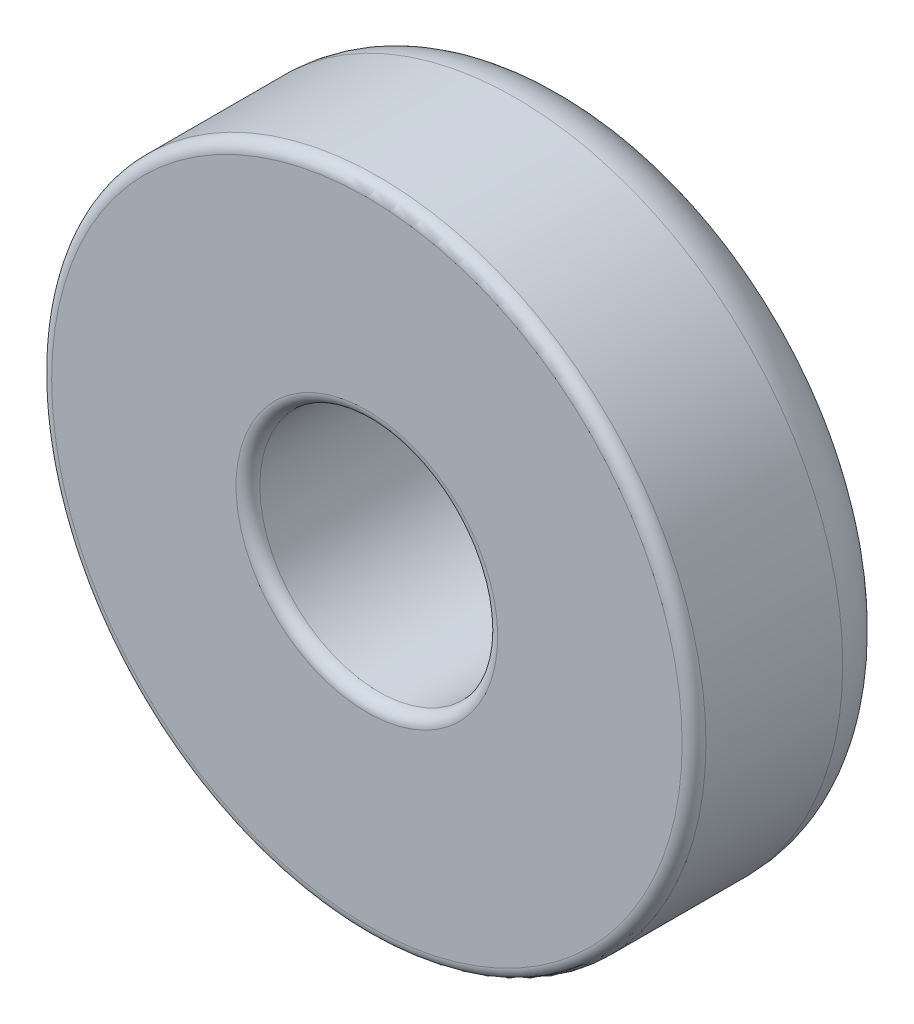
ISO-10303-21;
HEADER;
FILE_DESCRIPTION(('STEP AP214'),'2;1');
FILE_NAME('part.step','',(''),(''),'','','');
FILE_SCHEMA(('AUTOMOTIVE_DESIGN { 1 0 10303 214 1 1 1 1 }'));
ENDSEC;
DATA;
#1=APPLICATION_CONTEXT('core data for automotive mechanical design processes');
#2=APPLICATION_PROTOCOL_DEFINITION('international standard','automotive_design',2000,#1);
#3=PRODUCT_CONTEXT('',#1,'mechanical');
#4=PRODUCT('Part','Part','',(#3));
#5=PRODUCT_RELATED_PRODUCT_CATEGORY('part','',(#4));
#6=PRODUCT_DEFINITION_FORMATION('','',#4);
#7=PRODUCT_DEFINITION_CONTEXT('part definition',#1,'design');
#8=PRODUCT_DEFINITION('design','',#6,#7);
#9=PRODUCT_DEFINITION_SHAPE('','',#8);
#10=(LENGTH_UNIT() NAMED_UNIT(*) SI_UNIT(.MILLI.,.METRE.));
#11=(NAMED_UNIT(*) PLANE_ANGLE_UNIT() SI_UNIT($,.RADIAN.));
#12=(NAMED_UNIT(*) SI_UNIT($,.STERADIAN.) SOLID_ANGLE_UNIT());
#13=UNCERTAINTY_MEASURE_WITH_UNIT(LENGTH_MEASURE(1.E-05),#10,'distance_accuracy_value','');
#14=(GEOMETRIC_REPRESENTATION_CONTEXT(3) GLOBAL_UNCERTAINTY_ASSIGNED_CONTEXT((#13)) GLOBAL_UNIT_ASSIGNED_CONTEXT((#10,
#11,#12)) REPRESENTATION_CONTEXT('',''));
#15=CARTESIAN_POINT('',(0.,0.,0.));
#16=DIRECTION('',(0.,0.,1.));
#17=DIRECTION('',(1.,0.,0.));
#18=AXIS2_PLACEMENT_3D('',#15,#16,#17);
#19=CARTESIAN_POINT('',(0.,0.,1.75));
#20=DIRECTION('',(0.,0.,1.));
#21=DIRECTION('',(1.,0.,0.));
#22=AXIS2_PLACEMENT_3D('',#19,#20,#21);
#23=PLANE('',#22);
#24=CARTESIAN_POINT('',(0.,0.,1.75));
#25=DIRECTION('',(0.,0.,1.));
#26=DIRECTION('',(1.,0.,0.));
#27=AXIS2_PLACEMENT_3D('',#24,#25,#26);
#28=CIRCLE('',#27,2.65);
#29=CARTESIAN_POINT('',(2.65,0.,1.75));
#30=VERTEX_POINT('',#29);
#31=EDGE_CURVE('E65',#30,#30,#28,.T.);
#32=ORIENTED_EDGE('',*,*,#31,.T.);
#33=EDGE_LOOP('',(#32));
#34=FACE_BOUND('',#33,.T.);
#35=CARTESIAN_POINT('',(0.,0.,1.75));
#36=DIRECTION('',(0.,0.,1.));
#37=DIRECTION('',(1.,0.,0.));
#38=AXIS2_PLACEMENT_3D('',#35,#36,#37);
#39=CIRCLE('',#38,1.1);
#40=CARTESIAN_POINT('',(1.1,0.,1.75));
#41=VERTEX_POINT('',#40);
#42=EDGE_CURVE('E68',#41,#41,#39,.F.);
#43=ORIENTED_EDGE('',*,*,#42,.T.);
#44=EDGE_LOOP('',(#43));
#45=FACE_BOUND('',#44,.T.);
#46=ADVANCED_FACE('F45',(#34,#45),#23,.T.);
#47=CARTESIAN_POINT('',(0.,0.,0.));
#48=DIRECTION('',(0.,0.,1.));
#49=DIRECTION('',(1.,0.,0.));
#50=AXIS2_PLACEMENT_3D('',#47,#48,#49);
#51=PLANE('',#50);
#52=CARTESIAN_POINT('',(0.,0.,0.));
#53=DIRECTION('',(0.,0.,1.));
#54=DIRECTION('',(1.,0.,0.));
#55=AXIS2_PLACEMENT_3D('',#52,#53,#54);
#56=CIRCLE('',#55,1.1);
#57=CARTESIAN_POINT('',(1.1,0.,0.));
#58=VERTEX_POINT('',#57);
#59=EDGE_CURVE('E11',#58,#58,#56,.T.);
#60=ORIENTED_EDGE('',*,*,#59,.T.);
#61=EDGE_LOOP('',(#60));
#62=FACE_BOUND('',#61,.T.);
#63=CARTESIAN_POINT('',(0.,0.,0.));
#64=DIRECTION('',(0.,0.,1.));
#65=DIRECTION('',(1.,0.,0.));
#66=AXIS2_PLACEMENT_3D('',#63,#64,#65);
#67=CIRCLE('',#66,2.25);
#68=CARTESIAN_POINT('',(2.25,0.,0.));
#69=VERTEX_POINT('',#68);
#70=EDGE_CURVE('E71',#69,#69,#67,.F.);
#71=ORIENTED_EDGE('',*,*,#70,.T.);
#72=EDGE_LOOP('',(#71));
#73=FACE_BOUND('',#72,.T.);
#74=ADVANCED_FACE('F97',(#62,#73),#51,.F.);
#75=CARTESIAN_POINT('',(0.,0.,1.75));
#76=DIRECTION('',(0.,0.,-1.));
#77=DIRECTION('',(-1.,0.,0.));
#78=AXIS2_PLACEMENT_3D('',#75,#76,#77);
#79=CYLINDRICAL_SURFACE('',#78,2.75);
#80=CARTESIAN_POINT('',(0.,0.,1.65));
#81=DIRECTION('',(0.,0.,1.));
#82=DIRECTION('',(1.,0.,0.));
#83=AXIS2_PLACEMENT_3D('',#80,#81,#82);
#84=CIRCLE('',#83,2.75);
#85=CARTESIAN_POINT('',(2.75,0.,1.65));
#86=VERTEX_POINT('',#85);
#87=EDGE_CURVE('E60',#86,#86,#84,.F.);
#88=ORIENTED_EDGE('',*,*,#87,.T.);
#89=EDGE_LOOP('',(#88));
#90=FACE_BOUND('',#89,.T.);
#91=CARTESIAN_POINT('',(0.,0.,0.5));
#92=DIRECTION('',(0.,0.,1.));
#93=DIRECTION('',(1.,0.,0.));
#94=AXIS2_PLACEMENT_3D('',#91,#92,#93);
#95=CIRCLE('',#94,2.75);
#96=CARTESIAN_POINT('',(2.75,0.,0.5));
#97=VERTEX_POINT('',#96);
#98=EDGE_CURVE('E74',#97,#97,#95,.T.);
#99=ORIENTED_EDGE('',*,*,#98,.T.);
#100=EDGE_LOOP('',(#99));
#101=FACE_BOUND('',#100,.T.);
#102=ADVANCED_FACE('F78',(#90,#101),#79,.T.);
#103=CARTESIAN_POINT('',(0.,0.,1.75));
#104=DIRECTION('',(0.,0.,-1.));
#105=DIRECTION('',(-1.,0.,0.));
#106=AXIS2_PLACEMENT_3D('',#103,#104,#105);
#107=CYLINDRICAL_SURFACE('',#106,1.);
#108=CARTESIAN_POINT('',(0.,0.,1.65));
#109=DIRECTION('',(0.,0.,1.));
#110=DIRECTION('',(1.,0.,0.));
#111=AXIS2_PLACEMENT_3D('',#108,#109,#110);
#112=CIRCLE('',#111,1.);
#113=CARTESIAN_POINT('',(1.,0.,1.65));
#114=VERTEX_POINT('',#113);
#115=EDGE_CURVE('E52',#114,#114,#112,.T.);
#116=ORIENTED_EDGE('',*,*,#115,.T.);
#117=EDGE_LOOP('',(#116));
#118=FACE_BOUND('',#117,.T.);
#119=CARTESIAN_POINT('',(0.,0.,0.1));
#120=DIRECTION('',(0.,0.,1.));
#121=DIRECTION('',(1.,0.,0.));
#122=AXIS2_PLACEMENT_3D('',#119,#120,#121);
#123=CIRCLE('',#122,1.);
#124=CARTESIAN_POINT('',(1.,0.,0.1));
#125=VERTEX_POINT('',#124);
#126=EDGE_CURVE('E56',#125,#125,#123,.F.);
#127=ORIENTED_EDGE('',*,*,#126,.T.);
#128=EDGE_LOOP('',(#127));
#129=FACE_BOUND('',#128,.T.);
#130=ADVANCED_FACE('F83',(#118,#129),#107,.F.);
#131=CARTESIAN_POINT('',(0.,0.,0.5));
#132=DIRECTION('',(0.,0.,1.));
#133=DIRECTION('',(1.,0.,0.));
#134=AXIS2_PLACEMENT_3D('',#131,#132,#133);
#135=TOROIDAL_SURFACE('',#134,2.25,0.5);
#136=ORIENTED_EDGE('',*,*,#70,.F.);
#137=EDGE_LOOP('',(#136));
#138=FACE_BOUND('',#137,.T.);
#139=ORIENTED_EDGE('',*,*,#98,.F.);
#140=EDGE_LOOP('',(#139));
#141=FACE_BOUND('',#140,.T.);
#142=ADVANCED_FACE('F80',(#138,#141),#135,.T.);
#143=CARTESIAN_POINT('',(0.,0.,1.65));
#144=DIRECTION('',(0.,0.,1.));
#145=DIRECTION('',(1.,0.,0.));
#146=AXIS2_PLACEMENT_3D('',#143,#144,#145);
#147=TOROIDAL_SURFACE('',#146,2.65,0.1);
#148=ORIENTED_EDGE('',*,*,#87,.F.);
#149=EDGE_LOOP('',(#148));
#150=FACE_BOUND('',#149,.T.);
#151=ORIENTED_EDGE('',*,*,#31,.F.);
#152=EDGE_LOOP('',(#151));
#153=FACE_BOUND('',#152,.T.);
#154=ADVANCED_FACE('F82',(#150,#153),#147,.T.);
#155=CARTESIAN_POINT('',(0.,0.,1.65));
#156=DIRECTION('',(0.,0.,1.));
#157=DIRECTION('',(1.,0.,0.));
#158=AXIS2_PLACEMENT_3D('',#155,#156,#157);
#159=TOROIDAL_SURFACE('',#158,1.1,0.1);
#160=ORIENTED_EDGE('',*,*,#42,.F.);
#161=EDGE_LOOP('',(#160));
#162=FACE_BOUND('',#161,.T.);
#163=ORIENTED_EDGE('',*,*,#115,.F.);
#164=EDGE_LOOP('',(#163));
#165=FACE_BOUND('',#164,.T.);
#166=ADVANCED_FACE('F90',(#162,#165),#159,.T.);
#167=CARTESIAN_POINT('',(0.,0.,0.1));
#168=DIRECTION('',(0.,0.,1.));
#169=DIRECTION('',(1.,0.,0.));
#170=AXIS2_PLACEMENT_3D('',#167,#168,#169);
#171=TOROIDAL_SURFACE('',#170,1.1,0.1);
#172=ORIENTED_EDGE('',*,*,#126,.F.);
#173=EDGE_LOOP('',(#172));
#174=FACE_BOUND('',#173,.T.);
#175=ORIENTED_EDGE('',*,*,#59,.F.);
#176=EDGE_LOOP('',(#175));
#177=FACE_BOUND('',#176,.T.);
#178=ADVANCED_FACE('F47',(#174,#177),#171,.T.);
#179=CLOSED_SHELL('',(#46,#74,#102,#130,#142,#154,#166,#178));
#180=MANIFOLD_SOLID_BREP('B2',#179);
#181=ADVANCED_BREP_SHAPE_REPRESENTATION('',(#18,#180),#14);
#182=SHAPE_DEFINITION_REPRESENTATION(#9,#181);
ENDSEC;
END-ISO-10303-21;
